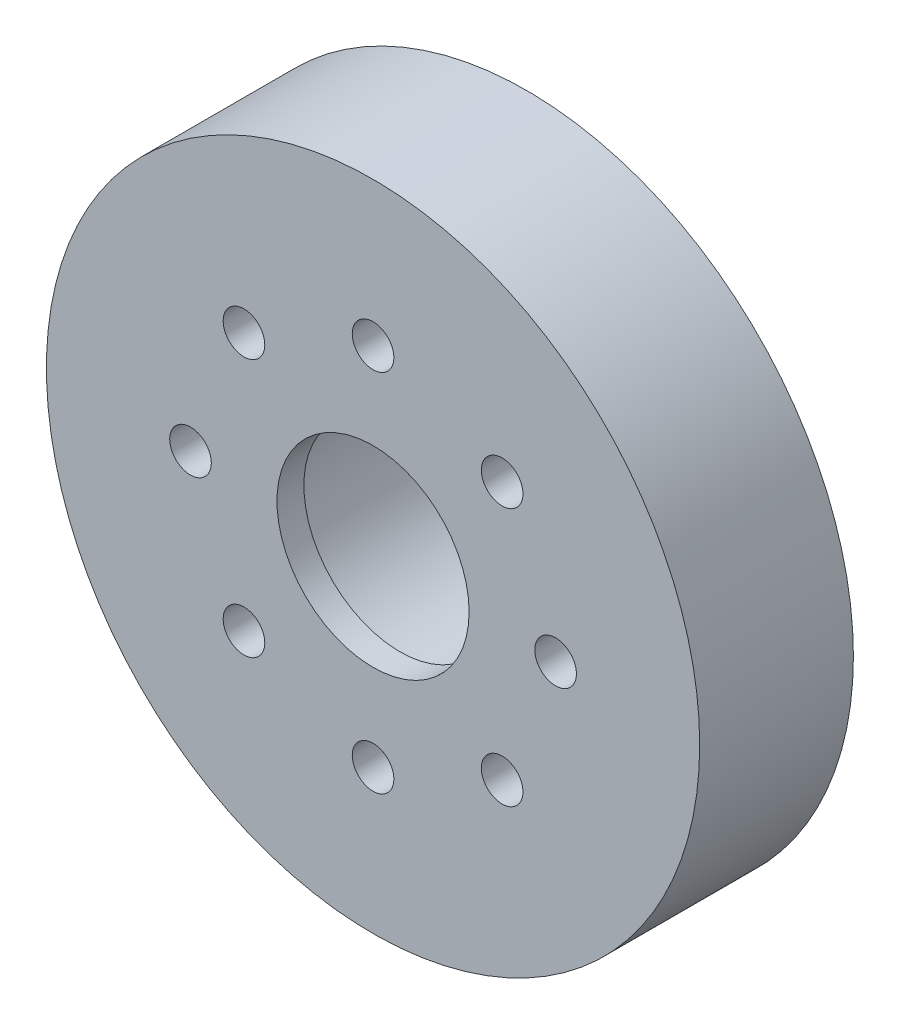
ISO-10303-21;
HEADER;
FILE_DESCRIPTION(('STEP AP214'),'2;1');
FILE_NAME('part.step','',(''),(''),'','','');
FILE_SCHEMA(('AUTOMOTIVE_DESIGN { 1 0 10303 214 1 1 1 1 }'));
ENDSEC;
DATA;
#1=APPLICATION_CONTEXT('core data for automotive mechanical design processes');
#2=APPLICATION_PROTOCOL_DEFINITION('international standard','automotive_design',2000,#1);
#3=PRODUCT_CONTEXT('',#1,'mechanical');
#4=PRODUCT('Part','Part','',(#3));
#5=PRODUCT_RELATED_PRODUCT_CATEGORY('part','',(#4));
#6=PRODUCT_DEFINITION_FORMATION('','',#4);
#7=PRODUCT_DEFINITION_CONTEXT('part definition',#1,'design');
#8=PRODUCT_DEFINITION('design','',#6,#7);
#9=PRODUCT_DEFINITION_SHAPE('','',#8);
#10=(LENGTH_UNIT() NAMED_UNIT(*) SI_UNIT(.MILLI.,.METRE.));
#11=(NAMED_UNIT(*) PLANE_ANGLE_UNIT() SI_UNIT($,.RADIAN.));
#12=(NAMED_UNIT(*) SI_UNIT($,.STERADIAN.) SOLID_ANGLE_UNIT());
#13=UNCERTAINTY_MEASURE_WITH_UNIT(LENGTH_MEASURE(1.E-05),#10,'distance_accuracy_value','');
#14=(GEOMETRIC_REPRESENTATION_CONTEXT(3) GLOBAL_UNCERTAINTY_ASSIGNED_CONTEXT((#13)) GLOBAL_UNIT_ASSIGNED_CONTEXT((#10,
#11,#12)) REPRESENTATION_CONTEXT('',''));
#15=CARTESIAN_POINT('',(0.,0.,0.));
#16=DIRECTION('',(0.,0.,1.));
#17=DIRECTION('',(1.,0.,0.));
#18=AXIS2_PLACEMENT_3D('',#15,#16,#17);
#19=CARTESIAN_POINT('',(0.,0.,0.));
#20=DIRECTION('',(0.,0.,1.));
#21=DIRECTION('',(1.,0.,0.));
#22=AXIS2_PLACEMENT_3D('',#19,#20,#21);
#23=PLANE('',#22);
#24=CARTESIAN_POINT('',(0.,0.,0.));
#25=DIRECTION('',(0.,0.,-1.));
#26=DIRECTION('',(-1.,0.,0.));
#27=AXIS2_PLACEMENT_3D('',#24,#25,#26);
#28=CIRCLE('',#27,15.7299152);
#29=CARTESIAN_POINT('',(-15.7299152,0.,0.));
#30=VERTEX_POINT('',#29);
#31=EDGE_CURVE('E59',#30,#30,#28,.T.);
#32=ORIENTED_EDGE('',*,*,#31,.F.);
#33=EDGE_LOOP('',(#32));
#34=FACE_BOUND('',#33,.T.);
#35=CARTESIAN_POINT('',(0.,0.,0.));
#36=DIRECTION('',(0.,0.,1.));
#37=DIRECTION('',(1.,0.,0.));
#38=AXIS2_PLACEMENT_3D('',#35,#36,#37);
#39=CIRCLE('',#38,43.18);
#40=CARTESIAN_POINT('',(43.18,0.,0.));
#41=VERTEX_POINT('',#40);
#42=EDGE_CURVE('E48',#41,#41,#39,.T.);
#43=ORIENTED_EDGE('',*,*,#42,.F.);
#44=EDGE_LOOP('',(#43));
#45=FACE_BOUND('',#44,.T.);
#46=CARTESIAN_POINT('',(0.,24.13,0.));
#47=DIRECTION('',(0.,0.,-1.));
#48=DIRECTION('',(-1.,0.,0.));
#49=AXIS2_PLACEMENT_3D('',#46,#47,#48);
#50=CIRCLE('',#49,2.75);
#51=CARTESIAN_POINT('',(-2.75,24.13,0.));
#52=VERTEX_POINT('',#51);
#53=EDGE_CURVE('E65',#52,#52,#50,.T.);
#54=ORIENTED_EDGE('',*,*,#53,.F.);
#55=EDGE_LOOP('',(#54));
#56=FACE_BOUND('',#55,.T.);
#57=CARTESIAN_POINT('',(17.0624866300314,17.0624866300314,0.));
#58=DIRECTION('',(0.,0.,-1.));
#59=DIRECTION('',(-1.,0.,0.));
#60=AXIS2_PLACEMENT_3D('',#57,#58,#59);
#61=CIRCLE('',#60,2.75);
#62=CARTESIAN_POINT('',(14.3124866300314,17.0624866300314,0.));
#63=VERTEX_POINT('',#62);
#64=EDGE_CURVE('E71',#63,#63,#61,.T.);
#65=ORIENTED_EDGE('',*,*,#64,.F.);
#66=EDGE_LOOP('',(#65));
#67=FACE_BOUND('',#66,.T.);
#68=CARTESIAN_POINT('',(24.13,0.,0.));
#69=DIRECTION('',(0.,0.,-1.));
#70=DIRECTION('',(-1.,0.,0.));
#71=AXIS2_PLACEMENT_3D('',#68,#69,#70);
#72=CIRCLE('',#71,2.75);
#73=CARTESIAN_POINT('',(21.38,0.,0.));
#74=VERTEX_POINT('',#73);
#75=EDGE_CURVE('E77',#74,#74,#72,.T.);
#76=ORIENTED_EDGE('',*,*,#75,.F.);
#77=EDGE_LOOP('',(#76));
#78=FACE_BOUND('',#77,.T.);
#79=CARTESIAN_POINT('',(17.0624866300313,-17.0624866300315,0.));
#80=DIRECTION('',(0.,0.,-1.));
#81=DIRECTION('',(-1.,0.,0.));
#82=AXIS2_PLACEMENT_3D('',#79,#80,#81);
#83=CIRCLE('',#82,2.75);
#84=CARTESIAN_POINT('',(14.3124866300313,-17.0624866300315,0.));
#85=VERTEX_POINT('',#84);
#86=EDGE_CURVE('E83',#85,#85,#83,.T.);
#87=ORIENTED_EDGE('',*,*,#86,.F.);
#88=EDGE_LOOP('',(#87));
#89=FACE_BOUND('',#88,.T.);
#90=CARTESIAN_POINT('',(0.,-24.13,0.));
#91=DIRECTION('',(0.,0.,-1.));
#92=DIRECTION('',(-1.,0.,0.));
#93=AXIS2_PLACEMENT_3D('',#90,#91,#92);
#94=CIRCLE('',#93,2.75);
#95=CARTESIAN_POINT('',(-2.75,-24.13,0.));
#96=VERTEX_POINT('',#95);
#97=EDGE_CURVE('E89',#96,#96,#94,.T.);
#98=ORIENTED_EDGE('',*,*,#97,.F.);
#99=EDGE_LOOP('',(#98));
#100=FACE_BOUND('',#99,.T.);
#101=CARTESIAN_POINT('',(-17.0624866300315,-17.0624866300312,0.));
#102=DIRECTION('',(0.,0.,-1.));
#103=DIRECTION('',(-1.,0.,0.));
#104=AXIS2_PLACEMENT_3D('',#101,#102,#103);
#105=CIRCLE('',#104,2.75);
#106=CARTESIAN_POINT('',(-19.8124866300315,-17.0624866300312,0.));
#107=VERTEX_POINT('',#106);
#108=EDGE_CURVE('E95',#107,#107,#105,.T.);
#109=ORIENTED_EDGE('',*,*,#108,.F.);
#110=EDGE_LOOP('',(#109));
#111=FACE_BOUND('',#110,.T.);
#112=CARTESIAN_POINT('',(-24.13,2.52748334118854E-13,0.));
#113=DIRECTION('',(0.,0.,-1.));
#114=DIRECTION('',(-1.,0.,0.));
#115=AXIS2_PLACEMENT_3D('',#112,#113,#114);
#116=CIRCLE('',#115,2.75);
#117=CARTESIAN_POINT('',(-26.88,2.52748334118854E-13,0.));
#118=VERTEX_POINT('',#117);
#119=EDGE_CURVE('E101',#118,#118,#116,.T.);
#120=ORIENTED_EDGE('',*,*,#119,.F.);
#121=EDGE_LOOP('',(#120));
#122=FACE_BOUND('',#121,.T.);
#123=CARTESIAN_POINT('',(-17.0624866300312,17.0624866300316,0.));
#124=DIRECTION('',(0.,0.,-1.));
#125=DIRECTION('',(-1.,0.,0.));
#126=AXIS2_PLACEMENT_3D('',#123,#124,#125);
#127=CIRCLE('',#126,2.75);
#128=CARTESIAN_POINT('',(-19.8124866300312,17.0624866300316,0.));
#129=VERTEX_POINT('',#128);
#130=EDGE_CURVE('E107',#129,#129,#127,.T.);
#131=ORIENTED_EDGE('',*,*,#130,.F.);
#132=EDGE_LOOP('',(#131));
#133=FACE_BOUND('',#132,.T.);
#134=ADVANCED_FACE('F44',(#34,#45,#56,#67,#78,#89,#100,#111,#122,#133),#23,.F.);
#135=CARTESIAN_POINT('',(0.,0.,20.32));
#136=DIRECTION('',(0.,0.,-1.));
#137=DIRECTION('',(-1.,0.,0.));
#138=AXIS2_PLACEMENT_3D('',#135,#136,#137);
#139=CYLINDRICAL_SURFACE('',#138,43.18);
#140=CARTESIAN_POINT('',(0.,0.,20.32));
#141=DIRECTION('',(0.,0.,1.));
#142=DIRECTION('',(1.,0.,0.));
#143=AXIS2_PLACEMENT_3D('',#140,#141,#142);
#144=CIRCLE('',#143,43.18);
#145=CARTESIAN_POINT('',(43.18,0.,20.32));
#146=VERTEX_POINT('',#145);
#147=EDGE_CURVE('E10',#146,#146,#144,.T.);
#148=ORIENTED_EDGE('',*,*,#147,.F.);
#149=EDGE_LOOP('',(#148));
#150=FACE_BOUND('',#149,.T.);
#151=ORIENTED_EDGE('',*,*,#42,.T.);
#152=EDGE_LOOP('',(#151));
#153=FACE_BOUND('',#152,.T.);
#154=ADVANCED_FACE('F46',(#150,#153),#139,.T.);
#155=CARTESIAN_POINT('',(0.,0.,20.32));
#156=DIRECTION('',(0.,0.,1.));
#157=DIRECTION('',(1.,0.,0.));
#158=AXIS2_PLACEMENT_3D('',#155,#156,#157);
#159=PLANE('',#158);
#160=CARTESIAN_POINT('',(-17.0624866300312,17.0624866300316,20.32));
#161=DIRECTION('',(0.,0.,1.));
#162=DIRECTION('',(1.,0.,0.));
#163=AXIS2_PLACEMENT_3D('',#160,#161,#162);
#164=CIRCLE('',#163,2.75);
#165=CARTESIAN_POINT('',(-14.3124866300312,17.0624866300316,20.32));
#166=VERTEX_POINT('',#165);
#167=EDGE_CURVE('E104',#166,#166,#164,.T.);
#168=ORIENTED_EDGE('',*,*,#167,.F.);
#169=EDGE_LOOP('',(#168));
#170=FACE_BOUND('',#169,.T.);
#171=CARTESIAN_POINT('',(-24.13,2.52748334118854E-13,20.32));
#172=DIRECTION('',(0.,0.,1.));
#173=DIRECTION('',(1.,0.,0.));
#174=AXIS2_PLACEMENT_3D('',#171,#172,#173);
#175=CIRCLE('',#174,2.75);
#176=CARTESIAN_POINT('',(-21.38,2.52748334118854E-13,20.32));
#177=VERTEX_POINT('',#176);
#178=EDGE_CURVE('E98',#177,#177,#175,.T.);
#179=ORIENTED_EDGE('',*,*,#178,.F.);
#180=EDGE_LOOP('',(#179));
#181=FACE_BOUND('',#180,.T.);
#182=CARTESIAN_POINT('',(-17.0624866300315,-17.0624866300312,20.32));
#183=DIRECTION('',(0.,0.,1.));
#184=DIRECTION('',(1.,0.,0.));
#185=AXIS2_PLACEMENT_3D('',#182,#183,#184);
#186=CIRCLE('',#185,2.75);
#187=CARTESIAN_POINT('',(-14.3124866300315,-17.0624866300312,20.32));
#188=VERTEX_POINT('',#187);
#189=EDGE_CURVE('E92',#188,#188,#186,.T.);
#190=ORIENTED_EDGE('',*,*,#189,.F.);
#191=EDGE_LOOP('',(#190));
#192=FACE_BOUND('',#191,.T.);
#193=CARTESIAN_POINT('',(0.,-24.13,20.32));
#194=DIRECTION('',(0.,0.,1.));
#195=DIRECTION('',(1.,0.,0.));
#196=AXIS2_PLACEMENT_3D('',#193,#194,#195);
#197=CIRCLE('',#196,2.75);
#198=CARTESIAN_POINT('',(2.75,-24.13,20.32));
#199=VERTEX_POINT('',#198);
#200=EDGE_CURVE('E86',#199,#199,#197,.T.);
#201=ORIENTED_EDGE('',*,*,#200,.F.);
#202=EDGE_LOOP('',(#201));
#203=FACE_BOUND('',#202,.T.);
#204=CARTESIAN_POINT('',(17.0624866300313,-17.0624866300315,20.32));
#205=DIRECTION('',(0.,0.,1.));
#206=DIRECTION('',(1.,0.,0.));
#207=AXIS2_PLACEMENT_3D('',#204,#205,#206);
#208=CIRCLE('',#207,2.75);
#209=CARTESIAN_POINT('',(19.8124866300313,-17.0624866300315,20.32));
#210=VERTEX_POINT('',#209);
#211=EDGE_CURVE('E80',#210,#210,#208,.T.);
#212=ORIENTED_EDGE('',*,*,#211,.F.);
#213=EDGE_LOOP('',(#212));
#214=FACE_BOUND('',#213,.T.);
#215=CARTESIAN_POINT('',(24.13,0.,20.32));
#216=DIRECTION('',(0.,0.,1.));
#217=DIRECTION('',(1.,0.,0.));
#218=AXIS2_PLACEMENT_3D('',#215,#216,#217);
#219=CIRCLE('',#218,2.75);
#220=CARTESIAN_POINT('',(26.88,0.,20.32));
#221=VERTEX_POINT('',#220);
#222=EDGE_CURVE('E74',#221,#221,#219,.T.);
#223=ORIENTED_EDGE('',*,*,#222,.F.);
#224=EDGE_LOOP('',(#223));
#225=FACE_BOUND('',#224,.T.);
#226=CARTESIAN_POINT('',(17.0624866300314,17.0624866300314,20.32));
#227=DIRECTION('',(0.,0.,1.));
#228=DIRECTION('',(1.,0.,0.));
#229=AXIS2_PLACEMENT_3D('',#226,#227,#228);
#230=CIRCLE('',#229,2.75);
#231=CARTESIAN_POINT('',(19.8124866300314,17.0624866300314,20.32));
#232=VERTEX_POINT('',#231);
#233=EDGE_CURVE('E68',#232,#232,#230,.T.);
#234=ORIENTED_EDGE('',*,*,#233,.F.);
#235=EDGE_LOOP('',(#234));
#236=FACE_BOUND('',#235,.T.);
#237=CARTESIAN_POINT('',(0.,24.13,20.32));
#238=DIRECTION('',(0.,0.,1.));
#239=DIRECTION('',(1.,0.,0.));
#240=AXIS2_PLACEMENT_3D('',#237,#238,#239);
#241=CIRCLE('',#240,2.75);
#242=CARTESIAN_POINT('',(2.75,24.13,20.32));
#243=VERTEX_POINT('',#242);
#244=EDGE_CURVE('E62',#243,#243,#241,.T.);
#245=ORIENTED_EDGE('',*,*,#244,.F.);
#246=EDGE_LOOP('',(#245));
#247=FACE_BOUND('',#246,.T.);
#248=ORIENTED_EDGE('',*,*,#147,.T.);
#249=EDGE_LOOP('',(#248));
#250=FACE_BOUND('',#249,.T.);
#251=CARTESIAN_POINT('',(0.,0.,20.32));
#252=DIRECTION('',(0.,0.,1.));
#253=DIRECTION('',(1.,0.,0.));
#254=AXIS2_PLACEMENT_3D('',#251,#252,#253);
#255=CIRCLE('',#254,12.7);
#256=CARTESIAN_POINT('',(12.7,0.,20.32));
#257=VERTEX_POINT('',#256);
#258=EDGE_CURVE('E113',#257,#257,#255,.T.);
#259=ORIENTED_EDGE('',*,*,#258,.F.);
#260=EDGE_LOOP('',(#259));
#261=FACE_BOUND('',#260,.T.);
#262=ADVANCED_FACE('F119',(#170,#181,#192,#203,#214,#225,#236,#247,#250,#261),#159,.T.);
#263=CARTESIAN_POINT('',(14.4907,0.,16.764));
#264=DIRECTION('',(0.,0.,1.));
#265=DIRECTION('',(1.,0.,0.));
#266=AXIS2_PLACEMENT_3D('',#263,#264,#265);
#267=PLANE('',#266);
#268=CARTESIAN_POINT('',(0.,0.,16.764));
#269=DIRECTION('',(0.,0.,-1.));
#270=DIRECTION('',(-1.,0.,0.));
#271=AXIS2_PLACEMENT_3D('',#268,#269,#270);
#272=CIRCLE('',#271,15.2279785901452);
#273=CARTESIAN_POINT('',(-15.2279785901452,0.,16.764));
#274=VERTEX_POINT('',#273);
#275=EDGE_CURVE('E55',#274,#274,#272,.T.);
#276=ORIENTED_EDGE('',*,*,#275,.T.);
#277=EDGE_LOOP('',(#276));
#278=FACE_BOUND('',#277,.T.);
#279=CARTESIAN_POINT('',(0.,0.,16.764));
#280=DIRECTION('',(0.,0.,1.));
#281=DIRECTION('',(1.,0.,0.));
#282=AXIS2_PLACEMENT_3D('',#279,#280,#281);
#283=CIRCLE('',#282,12.7);
#284=CARTESIAN_POINT('',(12.7,0.,16.764));
#285=VERTEX_POINT('',#284);
#286=EDGE_CURVE('E110',#285,#285,#283,.F.);
#287=ORIENTED_EDGE('',*,*,#286,.F.);
#288=EDGE_LOOP('',(#287));
#289=FACE_BOUND('',#288,.T.);
#290=ADVANCED_FACE('F121',(#278,#289),#267,.F.);
#291=CARTESIAN_POINT('',(0.,0.,0.));
#292=DIRECTION('',(0.,0.,-1.));
#293=DIRECTION('',(-1.,0.,0.));
#294=AXIS2_PLACEMENT_3D('',#291,#292,#293);
#295=CONICAL_SURFACE('',#294,15.7299152,0.0299323966717033);
#296=ORIENTED_EDGE('',*,*,#275,.F.);
#297=EDGE_LOOP('',(#296));
#298=FACE_BOUND('',#297,.T.);
#299=ORIENTED_EDGE('',*,*,#31,.T.);
#300=EDGE_LOOP('',(#299));
#301=FACE_BOUND('',#300,.T.);
#302=ADVANCED_FACE('F128',(#298,#301),#295,.F.);
#303=CARTESIAN_POINT('',(0.,24.13,0.));
#304=DIRECTION('',(0.,0.,-1.));
#305=DIRECTION('',(-1.,0.,0.));
#306=AXIS2_PLACEMENT_3D('',#303,#304,#305);
#307=CYLINDRICAL_SURFACE('',#306,2.75);
#308=ORIENTED_EDGE('',*,*,#53,.T.);
#309=EDGE_LOOP('',(#308));
#310=FACE_BOUND('',#309,.T.);
#311=ORIENTED_EDGE('',*,*,#244,.T.);
#312=EDGE_LOOP('',(#311));
#313=FACE_BOUND('',#312,.T.);
#314=ADVANCED_FACE('F192',(#310,#313),#307,.F.);
#315=CARTESIAN_POINT('',(17.0624866300314,17.0624866300314,0.));
#316=DIRECTION('',(0.,0.,-1.));
#317=DIRECTION('',(-1.,0.,0.));
#318=AXIS2_PLACEMENT_3D('',#315,#316,#317);
#319=CYLINDRICAL_SURFACE('',#318,2.75);
#320=ORIENTED_EDGE('',*,*,#64,.T.);
#321=EDGE_LOOP('',(#320));
#322=FACE_BOUND('',#321,.T.);
#323=ORIENTED_EDGE('',*,*,#233,.T.);
#324=EDGE_LOOP('',(#323));
#325=FACE_BOUND('',#324,.T.);
#326=ADVANCED_FACE('F189',(#322,#325),#319,.F.);
#327=CARTESIAN_POINT('',(24.13,0.,0.));
#328=DIRECTION('',(0.,0.,-1.));
#329=DIRECTION('',(-1.,0.,0.));
#330=AXIS2_PLACEMENT_3D('',#327,#328,#329);
#331=CYLINDRICAL_SURFACE('',#330,2.75);
#332=ORIENTED_EDGE('',*,*,#75,.T.);
#333=EDGE_LOOP('',(#332));
#334=FACE_BOUND('',#333,.T.);
#335=ORIENTED_EDGE('',*,*,#222,.T.);
#336=EDGE_LOOP('',(#335));
#337=FACE_BOUND('',#336,.T.);
#338=ADVANCED_FACE('F185',(#334,#337),#331,.F.);
#339=CARTESIAN_POINT('',(17.0624866300313,-17.0624866300315,0.));
#340=DIRECTION('',(0.,0.,-1.));
#341=DIRECTION('',(-1.,0.,0.));
#342=AXIS2_PLACEMENT_3D('',#339,#340,#341);
#343=CYLINDRICAL_SURFACE('',#342,2.75);
#344=ORIENTED_EDGE('',*,*,#86,.T.);
#345=EDGE_LOOP('',(#344));
#346=FACE_BOUND('',#345,.T.);
#347=ORIENTED_EDGE('',*,*,#211,.T.);
#348=EDGE_LOOP('',(#347));
#349=FACE_BOUND('',#348,.T.);
#350=ADVANCED_FACE('F181',(#346,#349),#343,.F.);
#351=CARTESIAN_POINT('',(0.,-24.13,0.));
#352=DIRECTION('',(0.,0.,-1.));
#353=DIRECTION('',(-1.,0.,0.));
#354=AXIS2_PLACEMENT_3D('',#351,#352,#353);
#355=CYLINDRICAL_SURFACE('',#354,2.75);
#356=ORIENTED_EDGE('',*,*,#97,.T.);
#357=EDGE_LOOP('',(#356));
#358=FACE_BOUND('',#357,.T.);
#359=ORIENTED_EDGE('',*,*,#200,.T.);
#360=EDGE_LOOP('',(#359));
#361=FACE_BOUND('',#360,.T.);
#362=ADVANCED_FACE('F177',(#358,#361),#355,.F.);
#363=CARTESIAN_POINT('',(-17.0624866300315,-17.0624866300312,0.));
#364=DIRECTION('',(0.,0.,-1.));
#365=DIRECTION('',(-1.,0.,0.));
#366=AXIS2_PLACEMENT_3D('',#363,#364,#365);
#367=CYLINDRICAL_SURFACE('',#366,2.75);
#368=ORIENTED_EDGE('',*,*,#108,.T.);
#369=EDGE_LOOP('',(#368));
#370=FACE_BOUND('',#369,.T.);
#371=ORIENTED_EDGE('',*,*,#189,.T.);
#372=EDGE_LOOP('',(#371));
#373=FACE_BOUND('',#372,.T.);
#374=ADVANCED_FACE('F171',(#370,#373),#367,.F.);
#375=CARTESIAN_POINT('',(-24.13,2.52748334118854E-13,0.));
#376=DIRECTION('',(0.,0.,-1.));
#377=DIRECTION('',(-1.,0.,0.));
#378=AXIS2_PLACEMENT_3D('',#375,#376,#377);
#379=CYLINDRICAL_SURFACE('',#378,2.75);
#380=ORIENTED_EDGE('',*,*,#119,.T.);
#381=EDGE_LOOP('',(#380));
#382=FACE_BOUND('',#381,.T.);
#383=ORIENTED_EDGE('',*,*,#178,.T.);
#384=EDGE_LOOP('',(#383));
#385=FACE_BOUND('',#384,.T.);
#386=ADVANCED_FACE('F163',(#382,#385),#379,.F.);
#387=CARTESIAN_POINT('',(-17.0624866300312,17.0624866300316,0.));
#388=DIRECTION('',(0.,0.,-1.));
#389=DIRECTION('',(-1.,0.,0.));
#390=AXIS2_PLACEMENT_3D('',#387,#388,#389);
#391=CYLINDRICAL_SURFACE('',#390,2.75);
#392=ORIENTED_EDGE('',*,*,#130,.T.);
#393=EDGE_LOOP('',(#392));
#394=FACE_BOUND('',#393,.T.);
#395=ORIENTED_EDGE('',*,*,#167,.T.);
#396=EDGE_LOOP('',(#395));
#397=FACE_BOUND('',#396,.T.);
#398=ADVANCED_FACE('F161',(#394,#397),#391,.F.);
#399=CARTESIAN_POINT('',(0.,0.,-24.2218889365596));
#400=DIRECTION('',(0.,0.,1.));
#401=DIRECTION('',(1.,0.,0.));
#402=AXIS2_PLACEMENT_3D('',#399,#400,#401);
#403=CYLINDRICAL_SURFACE('',#402,12.7);
#404=ORIENTED_EDGE('',*,*,#286,.T.);
#405=EDGE_LOOP('',(#404));
#406=FACE_BOUND('',#405,.T.);
#407=ORIENTED_EDGE('',*,*,#258,.T.);
#408=EDGE_LOOP('',(#407));
#409=FACE_BOUND('',#408,.T.);
#410=ADVANCED_FACE('F117',(#406,#409),#403,.F.);
#411=CLOSED_SHELL('',(#134,#154,#262,#290,#302,#314,#326,#338,#350,#362,#374,#386,#398,#410));
#412=MANIFOLD_SOLID_BREP('B2',#411);
#413=ADVANCED_BREP_SHAPE_REPRESENTATION('',(#18,#412),#14);
#414=SHAPE_DEFINITION_REPRESENTATION(#9,#413);
ENDSEC;
END-ISO-10303-21;
